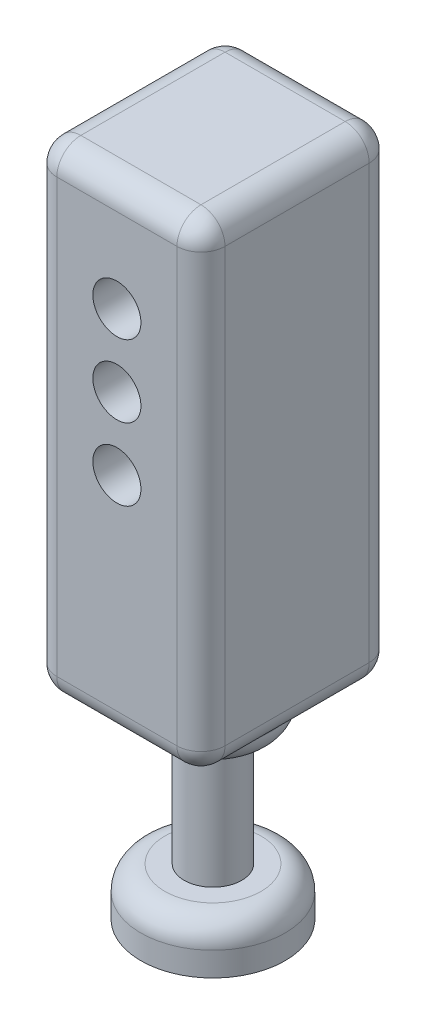
ISO-10303-21;
HEADER;
FILE_DESCRIPTION(('STEP AP214'),'2;1');
FILE_NAME('part.step','',(''),(''),'','','');
FILE_SCHEMA(('AUTOMOTIVE_DESIGN { 1 0 10303 214 1 1 1 1 }'));
ENDSEC;
DATA;
#1=APPLICATION_CONTEXT('core data for automotive mechanical design processes');
#2=APPLICATION_PROTOCOL_DEFINITION('international standard','automotive_design',2000,#1);
#3=PRODUCT_CONTEXT('',#1,'mechanical');
#4=PRODUCT('Part','Part','',(#3));
#5=PRODUCT_RELATED_PRODUCT_CATEGORY('part','',(#4));
#6=PRODUCT_DEFINITION_FORMATION('','',#4);
#7=PRODUCT_DEFINITION_CONTEXT('part definition',#1,'design');
#8=PRODUCT_DEFINITION('design','',#6,#7);
#9=PRODUCT_DEFINITION_SHAPE('','',#8);
#10=(LENGTH_UNIT() NAMED_UNIT(*) SI_UNIT(.MILLI.,.METRE.));
#11=(NAMED_UNIT(*) PLANE_ANGLE_UNIT() SI_UNIT($,.RADIAN.));
#12=(NAMED_UNIT(*) SI_UNIT($,.STERADIAN.) SOLID_ANGLE_UNIT());
#13=UNCERTAINTY_MEASURE_WITH_UNIT(LENGTH_MEASURE(1.E-05),#10,'distance_accuracy_value','');
#14=(GEOMETRIC_REPRESENTATION_CONTEXT(3) GLOBAL_UNCERTAINTY_ASSIGNED_CONTEXT((#13)) GLOBAL_UNIT_ASSIGNED_CONTEXT((#10,
#11,#12)) REPRESENTATION_CONTEXT('',''));
#15=CARTESIAN_POINT('',(0.,0.,0.));
#16=DIRECTION('',(0.,0.,1.));
#17=DIRECTION('',(1.,0.,0.));
#18=AXIS2_PLACEMENT_3D('',#15,#16,#17);
#19=CARTESIAN_POINT('',(-14.7765246655152,101.448561813307,80.));
#20=DIRECTION('',(1.,0.,0.));
#21=DIRECTION('',(0.,1.,0.));
#22=AXIS2_PLACEMENT_3D('',#19,#20,#21);
#23=PLANE('',#22);
#24=DIRECTION('',(0.,-1.,0.));
#25=VECTOR('',#24,1.);
#26=CARTESIAN_POINT('',(-14.7765246655152,101.448561813307,9.99999999999999));
#27=LINE('',#26,#25);
#28=CARTESIAN_POINT('',(-14.7765246655152,91.4485618133073,9.99999999999999));
#29=VERTEX_POINT('',#28);
#30=CARTESIAN_POINT('',(-14.7765246655151,-88.5514381866927,9.99999999999999));
#31=VERTEX_POINT('',#30);
#32=EDGE_CURVE('E387',#29,#31,#27,.T.);
#33=ORIENTED_EDGE('',*,*,#32,.T.);
#34=DIRECTION('',(0.,0.,-1.));
#35=VECTOR('',#34,1.);
#36=CARTESIAN_POINT('',(-14.7765246655151,-88.5514381866927,80.));
#37=LINE('',#36,#35);
#38=CARTESIAN_POINT('',(-14.7765246655151,-88.5514381866927,70.));
#39=VERTEX_POINT('',#38);
#40=EDGE_CURVE('E391',#31,#39,#37,.F.);
#41=ORIENTED_EDGE('',*,*,#40,.T.);
#42=DIRECTION('',(0.,-1.,0.));
#43=VECTOR('',#42,1.);
#44=CARTESIAN_POINT('',(-14.7765246655152,101.448561813307,70.));
#45=LINE('',#44,#43);
#46=CARTESIAN_POINT('',(-14.7765246655152,91.4485618133073,70.));
#47=VERTEX_POINT('',#46);
#48=EDGE_CURVE('E389',#39,#47,#45,.F.);
#49=ORIENTED_EDGE('',*,*,#48,.T.);
#50=DIRECTION('',(0.,0.,-1.));
#51=VECTOR('',#50,1.);
#52=CARTESIAN_POINT('',(-14.7765246655152,91.4485618133073,80.));
#53=LINE('',#52,#51);
#54=EDGE_CURVE('E385',#47,#29,#53,.T.);
#55=ORIENTED_EDGE('',*,*,#54,.T.);
#56=EDGE_LOOP('',(#33,#41,#49,#55));
#57=FACE_BOUND('',#56,.T.);
#58=ADVANCED_FACE('F38',(#57),#23,.F.);
#59=CARTESIAN_POINT('',(-14.7765246655151,-98.5514381866927,80.));
#60=DIRECTION('',(0.,1.,0.));
#61=DIRECTION('',(0.,0.,1.));
#62=AXIS2_PLACEMENT_3D('',#59,#60,#61);
#63=PLANE('',#62);
#64=CARTESIAN_POINT('',(20.2234753344849,-98.5514381866927,40.));
#65=DIRECTION('',(0.,1.,0.));
#66=DIRECTION('',(0.,0.,1.));
#67=AXIS2_PLACEMENT_3D('',#64,#65,#66);
#68=CIRCLE('',#67,24.4425210792579);
#69=CARTESIAN_POINT('',(20.2234753344849,-98.5514381866927,64.4425210792579));
#70=VERTEX_POINT('',#69);
#71=EDGE_CURVE('E208',#70,#70,#68,.F.);
#72=ORIENTED_EDGE('',*,*,#71,.F.);
#73=EDGE_LOOP('',(#72));
#74=FACE_BOUND('',#73,.T.);
#75=DIRECTION('',(1.,0.,0.));
#76=VECTOR('',#75,1.);
#77=CARTESIAN_POINT('',(-14.7765246655151,-98.5514381866927,70.));
#78=LINE('',#77,#76);
#79=CARTESIAN_POINT('',(45.2234753344849,-98.5514381866927,70.));
#80=VERTEX_POINT('',#79);
#81=CARTESIAN_POINT('',(-4.77652466551515,-98.5514381866927,70.));
#82=VERTEX_POINT('',#81);
#83=EDGE_CURVE('E140',#80,#82,#78,.F.);
#84=ORIENTED_EDGE('',*,*,#83,.T.);
#85=DIRECTION('',(0.,0.,-1.));
#86=VECTOR('',#85,1.);
#87=CARTESIAN_POINT('',(-4.77652466551515,-98.5514381866927,80.));
#88=LINE('',#87,#86);
#89=CARTESIAN_POINT('',(-4.77652466551515,-98.5514381866927,9.99999999999999));
#90=VERTEX_POINT('',#89);
#91=EDGE_CURVE('E136',#82,#90,#88,.T.);
#92=ORIENTED_EDGE('',*,*,#91,.T.);
#93=DIRECTION('',(1.,0.,0.));
#94=VECTOR('',#93,1.);
#95=CARTESIAN_POINT('',(-14.7765246655151,-98.5514381866927,9.99999999999999));
#96=LINE('',#95,#94);
#97=CARTESIAN_POINT('',(45.2234753344849,-98.5514381866927,9.99999999999999));
#98=VERTEX_POINT('',#97);
#99=EDGE_CURVE('E130',#90,#98,#96,.T.);
#100=ORIENTED_EDGE('',*,*,#99,.T.);
#101=DIRECTION('',(0.,0.,-1.));
#102=VECTOR('',#101,1.);
#103=CARTESIAN_POINT('',(45.2234753344849,-98.5514381866927,80.));
#104=LINE('',#103,#102);
#105=EDGE_CURVE('E133',#98,#80,#104,.F.);
#106=ORIENTED_EDGE('',*,*,#105,.T.);
#107=EDGE_LOOP('',(#84,#92,#100,#106));
#108=FACE_BOUND('',#107,.T.);
#109=ADVANCED_FACE('F132',(#74,#108),#63,.F.);
#110=CARTESIAN_POINT('',(55.2234753344848,101.448561813307,80.));
#111=DIRECTION('',(-1.,0.,0.));
#112=DIRECTION('',(0.,-1.,0.));
#113=AXIS2_PLACEMENT_3D('',#110,#111,#112);
#114=PLANE('',#113);
#115=DIRECTION('',(0.,1.,0.));
#116=VECTOR('',#115,1.);
#117=CARTESIAN_POINT('',(55.2234753344849,-98.5514381866927,70.));
#118=LINE('',#117,#116);
#119=CARTESIAN_POINT('',(55.2234753344848,91.4485618133073,70.));
#120=VERTEX_POINT('',#119);
#121=CARTESIAN_POINT('',(55.2234753344849,-88.5514381866927,70.));
#122=VERTEX_POINT('',#121);
#123=EDGE_CURVE('E362',#120,#122,#118,.F.);
#124=ORIENTED_EDGE('',*,*,#123,.T.);
#125=DIRECTION('',(0.,0.,-1.));
#126=VECTOR('',#125,1.);
#127=CARTESIAN_POINT('',(55.2234753344849,-88.5514381866927,80.));
#128=LINE('',#127,#126);
#129=CARTESIAN_POINT('',(55.2234753344849,-88.5514381866927,9.99999999999999));
#130=VERTEX_POINT('',#129);
#131=EDGE_CURVE('E363',#122,#130,#128,.T.);
#132=ORIENTED_EDGE('',*,*,#131,.T.);
#133=DIRECTION('',(0.,1.,0.));
#134=VECTOR('',#133,1.);
#135=CARTESIAN_POINT('',(55.2234753344848,101.448561813307,9.99999999999999));
#136=LINE('',#135,#134);
#137=CARTESIAN_POINT('',(55.2234753344848,91.4485618133073,9.99999999999999));
#138=VERTEX_POINT('',#137);
#139=EDGE_CURVE('E368',#130,#138,#136,.T.);
#140=ORIENTED_EDGE('',*,*,#139,.T.);
#141=DIRECTION('',(0.,0.,-1.));
#142=VECTOR('',#141,1.);
#143=CARTESIAN_POINT('',(55.2234753344848,91.4485618133073,80.));
#144=LINE('',#143,#142);
#145=EDGE_CURVE('E365',#138,#120,#144,.F.);
#146=ORIENTED_EDGE('',*,*,#145,.T.);
#147=EDGE_LOOP('',(#124,#132,#140,#146));
#148=FACE_BOUND('',#147,.T.);
#149=ADVANCED_FACE('F243',(#148),#114,.F.);
#150=CARTESIAN_POINT('',(-14.7765246655152,101.448561813307,80.));
#151=DIRECTION('',(0.,-1.,0.));
#152=DIRECTION('',(0.,0.,-1.));
#153=AXIS2_PLACEMENT_3D('',#150,#151,#152);
#154=PLANE('',#153);
#155=DIRECTION('',(-1.,0.,0.));
#156=VECTOR('',#155,1.);
#157=CARTESIAN_POINT('',(55.2234753344848,101.448561813307,70.));
#158=LINE('',#157,#156);
#159=CARTESIAN_POINT('',(-4.77652466551517,101.448561813307,70.));
#160=VERTEX_POINT('',#159);
#161=CARTESIAN_POINT('',(45.2234753344848,101.448561813307,70.));
#162=VERTEX_POINT('',#161);
#163=EDGE_CURVE('E413',#160,#162,#158,.F.);
#164=ORIENTED_EDGE('',*,*,#163,.T.);
#165=DIRECTION('',(0.,0.,-1.));
#166=VECTOR('',#165,1.);
#167=CARTESIAN_POINT('',(45.2234753344848,101.448561813307,80.));
#168=LINE('',#167,#166);
#169=CARTESIAN_POINT('',(45.2234753344848,101.448561813307,9.99999999999999));
#170=VERTEX_POINT('',#169);
#171=EDGE_CURVE('E61',#162,#170,#168,.T.);
#172=ORIENTED_EDGE('',*,*,#171,.T.);
#173=DIRECTION('',(-1.,0.,0.));
#174=VECTOR('',#173,1.);
#175=CARTESIAN_POINT('',(-14.7765246655152,101.448561813307,9.99999999999999));
#176=LINE('',#175,#174);
#177=CARTESIAN_POINT('',(-4.77652466551517,101.448561813307,9.99999999999999));
#178=VERTEX_POINT('',#177);
#179=EDGE_CURVE('E411',#170,#178,#176,.T.);
#180=ORIENTED_EDGE('',*,*,#179,.T.);
#181=DIRECTION('',(0.,0.,-1.));
#182=VECTOR('',#181,1.);
#183=CARTESIAN_POINT('',(-4.77652466551517,101.448561813307,80.));
#184=LINE('',#183,#182);
#185=EDGE_CURVE('E370',#178,#160,#184,.F.);
#186=ORIENTED_EDGE('',*,*,#185,.T.);
#187=EDGE_LOOP('',(#164,#172,#180,#186));
#188=FACE_BOUND('',#187,.T.);
#189=ADVANCED_FACE('F350',(#188),#154,.F.);
#190=CARTESIAN_POINT('',(0.,0.,80.));
#191=DIRECTION('',(0.,0.,1.));
#192=DIRECTION('',(1.,0.,0.));
#193=AXIS2_PLACEMENT_3D('',#190,#191,#192);
#194=PLANE('',#193);
#195=CARTESIAN_POINT('',(20.2234753344848,56.4485618133073,80.));
#196=DIRECTION('',(0.,0.,1.));
#197=DIRECTION('',(1.,0.,0.));
#198=AXIS2_PLACEMENT_3D('',#195,#196,#197);
#199=CIRCLE('',#198,10.);
#200=CARTESIAN_POINT('',(30.2234753344848,56.4485618133073,80.));
#201=VERTEX_POINT('',#200);
#202=EDGE_CURVE('E474',#201,#201,#199,.T.);
#203=ORIENTED_EDGE('',*,*,#202,.F.);
#204=EDGE_LOOP('',(#203));
#205=FACE_BOUND('',#204,.T.);
#206=CARTESIAN_POINT('',(20.2234753344848,26.4485618133073,80.));
#207=DIRECTION('',(0.,0.,1.));
#208=DIRECTION('',(1.,0.,0.));
#209=AXIS2_PLACEMENT_3D('',#206,#207,#208);
#210=CIRCLE('',#209,10.);
#211=CARTESIAN_POINT('',(30.2234753344848,26.4485618133073,80.));
#212=VERTEX_POINT('',#211);
#213=EDGE_CURVE('E468',#212,#212,#210,.T.);
#214=ORIENTED_EDGE('',*,*,#213,.F.);
#215=EDGE_LOOP('',(#214));
#216=FACE_BOUND('',#215,.T.);
#217=CARTESIAN_POINT('',(20.2234753344848,-3.55143818669267,80.));
#218=DIRECTION('',(0.,0.,1.));
#219=DIRECTION('',(1.,0.,0.));
#220=AXIS2_PLACEMENT_3D('',#217,#218,#219);
#221=CIRCLE('',#220,10.);
#222=CARTESIAN_POINT('',(30.2234753344848,-3.55143818669267,80.));
#223=VERTEX_POINT('',#222);
#224=EDGE_CURVE('E462',#223,#223,#221,.T.);
#225=ORIENTED_EDGE('',*,*,#224,.F.);
#226=EDGE_LOOP('',(#225));
#227=FACE_BOUND('',#226,.T.);
#228=DIRECTION('',(0.,-1.,0.));
#229=VECTOR('',#228,1.);
#230=CARTESIAN_POINT('',(-4.77652466551514,-98.5514381866927,80.));
#231=LINE('',#230,#229);
#232=CARTESIAN_POINT('',(-4.77652466551517,91.4485618133073,80.));
#233=VERTEX_POINT('',#232);
#234=CARTESIAN_POINT('',(-4.77652466551514,-88.5514381866927,80.));
#235=VERTEX_POINT('',#234);
#236=EDGE_CURVE('E403',#233,#235,#231,.T.);
#237=ORIENTED_EDGE('',*,*,#236,.T.);
#238=DIRECTION('',(1.,0.,0.));
#239=VECTOR('',#238,1.);
#240=CARTESIAN_POINT('',(55.2234753344849,-88.5514381866927,80.));
#241=LINE('',#240,#239);
#242=CARTESIAN_POINT('',(45.2234753344849,-88.5514381866927,80.));
#243=VERTEX_POINT('',#242);
#244=EDGE_CURVE('E406',#235,#243,#241,.T.);
#245=ORIENTED_EDGE('',*,*,#244,.T.);
#246=DIRECTION('',(0.,1.,0.));
#247=VECTOR('',#246,1.);
#248=CARTESIAN_POINT('',(45.2234753344848,101.448561813307,80.));
#249=LINE('',#248,#247);
#250=CARTESIAN_POINT('',(45.2234753344848,91.4485618133073,80.));
#251=VERTEX_POINT('',#250);
#252=EDGE_CURVE('E373',#243,#251,#249,.T.);
#253=ORIENTED_EDGE('',*,*,#252,.T.);
#254=DIRECTION('',(-1.,0.,0.));
#255=VECTOR('',#254,1.);
#256=CARTESIAN_POINT('',(-14.7765246655152,91.4485618133073,80.));
#257=LINE('',#256,#255);
#258=EDGE_CURVE('E401',#251,#233,#257,.T.);
#259=ORIENTED_EDGE('',*,*,#258,.T.);
#260=EDGE_LOOP('',(#237,#245,#253,#259));
#261=FACE_BOUND('',#260,.T.);
#262=ADVANCED_FACE('F347',(#205,#216,#227,#261),#194,.T.);
#263=CARTESIAN_POINT('',(0.,0.,0.));
#264=DIRECTION('',(0.,0.,1.));
#265=DIRECTION('',(1.,0.,0.));
#266=AXIS2_PLACEMENT_3D('',#263,#264,#265);
#267=PLANE('',#266);
#268=CARTESIAN_POINT('',(20.2234753344848,56.4485618133073,0.));
#269=DIRECTION('',(0.,0.,1.));
#270=DIRECTION('',(1.,0.,0.));
#271=AXIS2_PLACEMENT_3D('',#268,#269,#270);
#272=CIRCLE('',#271,10.);
#273=CARTESIAN_POINT('',(30.2234753344848,56.4485618133073,0.));
#274=VERTEX_POINT('',#273);
#275=EDGE_CURVE('E461',#274,#274,#272,.T.);
#276=ORIENTED_EDGE('',*,*,#275,.T.);
#277=EDGE_LOOP('',(#276));
#278=FACE_BOUND('',#277,.T.);
#279=CARTESIAN_POINT('',(20.2234753344848,26.4485618133073,0.));
#280=DIRECTION('',(0.,0.,1.));
#281=DIRECTION('',(1.,0.,0.));
#282=AXIS2_PLACEMENT_3D('',#279,#280,#281);
#283=CIRCLE('',#282,10.);
#284=CARTESIAN_POINT('',(30.2234753344848,26.4485618133073,0.));
#285=VERTEX_POINT('',#284);
#286=EDGE_CURVE('E471',#285,#285,#283,.T.);
#287=ORIENTED_EDGE('',*,*,#286,.T.);
#288=EDGE_LOOP('',(#287));
#289=FACE_BOUND('',#288,.T.);
#290=CARTESIAN_POINT('',(20.2234753344848,-3.55143818669267,0.));
#291=DIRECTION('',(0.,0.,1.));
#292=DIRECTION('',(1.,0.,0.));
#293=AXIS2_PLACEMENT_3D('',#290,#291,#292);
#294=CIRCLE('',#293,10.);
#295=CARTESIAN_POINT('',(30.2234753344848,-3.55143818669267,0.));
#296=VERTEX_POINT('',#295);
#297=EDGE_CURVE('E465',#296,#296,#294,.T.);
#298=ORIENTED_EDGE('',*,*,#297,.T.);
#299=EDGE_LOOP('',(#298));
#300=FACE_BOUND('',#299,.T.);
#301=DIRECTION('',(0.,1.,0.));
#302=VECTOR('',#301,1.);
#303=CARTESIAN_POINT('',(45.2234753344848,0.,0.));
#304=LINE('',#303,#302);
#305=CARTESIAN_POINT('',(45.2234753344848,91.4485618133073,0.));
#306=VERTEX_POINT('',#305);
#307=CARTESIAN_POINT('',(45.2234753344849,-88.5514381866927,0.));
#308=VERTEX_POINT('',#307);
#309=EDGE_CURVE('E398',#306,#308,#304,.F.);
#310=ORIENTED_EDGE('',*,*,#309,.T.);
#311=DIRECTION('',(1.,0.,0.));
#312=VECTOR('',#311,1.);
#313=CARTESIAN_POINT('',(0.,-88.5514381866927,0.));
#314=LINE('',#313,#312);
#315=CARTESIAN_POINT('',(-4.77652466551514,-88.5514381866927,0.));
#316=VERTEX_POINT('',#315);
#317=EDGE_CURVE('E164',#308,#316,#314,.F.);
#318=ORIENTED_EDGE('',*,*,#317,.T.);
#319=DIRECTION('',(0.,-1.,0.));
#320=VECTOR('',#319,1.);
#321=CARTESIAN_POINT('',(-4.77652466551516,0.,0.));
#322=LINE('',#321,#320);
#323=CARTESIAN_POINT('',(-4.77652466551517,91.4485618133073,0.));
#324=VERTEX_POINT('',#323);
#325=EDGE_CURVE('E396',#316,#324,#322,.F.);
#326=ORIENTED_EDGE('',*,*,#325,.T.);
#327=DIRECTION('',(-1.,0.,0.));
#328=VECTOR('',#327,1.);
#329=CARTESIAN_POINT('',(0.,91.4485618133073,0.));
#330=LINE('',#329,#328);
#331=EDGE_CURVE('E394',#324,#306,#330,.F.);
#332=ORIENTED_EDGE('',*,*,#331,.T.);
#333=EDGE_LOOP('',(#310,#318,#326,#332));
#334=FACE_BOUND('',#333,.T.);
#335=ADVANCED_FACE('F320',(#278,#289,#300,#334),#267,.F.);
#336=CARTESIAN_POINT('',(45.2234753344848,91.4485618133073,80.));
#337=DIRECTION('',(0.,0.,-1.));
#338=DIRECTION('',(-1.,0.,0.));
#339=AXIS2_PLACEMENT_3D('',#336,#337,#338);
#340=CYLINDRICAL_SURFACE('',#339,10.);
#341=CARTESIAN_POINT('',(45.2234753344848,91.4485618133073,70.));
#342=DIRECTION('',(0.,0.,1.));
#343=DIRECTION('',(1.,0.,0.));
#344=AXIS2_PLACEMENT_3D('',#341,#342,#343);
#345=CIRCLE('',#344,10.);
#346=EDGE_CURVE('E152',#120,#162,#345,.T.);
#347=ORIENTED_EDGE('',*,*,#346,.F.);
#348=ORIENTED_EDGE('',*,*,#145,.F.);
#349=CARTESIAN_POINT('',(45.2234753344848,91.4485618133073,9.99999999999999));
#350=DIRECTION('',(0.,0.,-1.));
#351=DIRECTION('',(-1.,0.,0.));
#352=AXIS2_PLACEMENT_3D('',#349,#350,#351);
#353=CIRCLE('',#352,10.);
#354=EDGE_CURVE('E204',#170,#138,#353,.T.);
#355=ORIENTED_EDGE('',*,*,#354,.F.);
#356=ORIENTED_EDGE('',*,*,#171,.F.);
#357=EDGE_LOOP('',(#347,#348,#355,#356));
#358=FACE_BOUND('',#357,.T.);
#359=ADVANCED_FACE('F317',(#358),#340,.T.);
#360=CARTESIAN_POINT('',(45.2234753344848,91.4485618133073,70.));
#361=DIRECTION('',(0.,0.,1.));
#362=DIRECTION('',(1.,0.,0.));
#363=AXIS2_PLACEMENT_3D('',#360,#361,#362);
#364=SPHERICAL_SURFACE('',#363,10.);
#365=CARTESIAN_POINT('',(45.2234753344848,91.4485618133073,70.));
#366=DIRECTION('',(0.,1.,0.));
#367=DIRECTION('',(0.,0.,1.));
#368=AXIS2_PLACEMENT_3D('',#365,#366,#367);
#369=CIRCLE('',#368,10.);
#370=EDGE_CURVE('E200',#120,#251,#369,.F.);
#371=ORIENTED_EDGE('',*,*,#370,.F.);
#372=ORIENTED_EDGE('',*,*,#346,.T.);
#373=CARTESIAN_POINT('',(45.2234753344848,91.4485618133073,70.));
#374=DIRECTION('',(1.,0.,0.));
#375=DIRECTION('',(0.,0.,-1.));
#376=AXIS2_PLACEMENT_3D('',#373,#374,#375);
#377=CIRCLE('',#376,10.);
#378=EDGE_CURVE('E53',#251,#162,#377,.F.);
#379=ORIENTED_EDGE('',*,*,#378,.F.);
#380=EDGE_LOOP('',(#371,#372,#379));
#381=FACE_BOUND('',#380,.T.);
#382=ADVANCED_FACE('F313',(#381),#364,.T.);
#383=CARTESIAN_POINT('',(45.2234753344848,91.4485618133073,10.));
#384=DIRECTION('',(0.,0.,1.));
#385=DIRECTION('',(1.,0.,0.));
#386=AXIS2_PLACEMENT_3D('',#383,#384,#385);
#387=SPHERICAL_SURFACE('',#386,10.);
#388=CARTESIAN_POINT('',(45.2234753344848,91.4485618133073,10.));
#389=DIRECTION('',(1.,0.,0.));
#390=DIRECTION('',(0.,0.,-1.));
#391=AXIS2_PLACEMENT_3D('',#388,#389,#390);
#392=CIRCLE('',#391,10.);
#393=EDGE_CURVE('E194',#170,#306,#392,.F.);
#394=ORIENTED_EDGE('',*,*,#393,.F.);
#395=ORIENTED_EDGE('',*,*,#354,.T.);
#396=CARTESIAN_POINT('',(45.2234753344848,91.4485618133073,9.99999999999999));
#397=DIRECTION('',(0.,1.,0.));
#398=DIRECTION('',(0.,0.,1.));
#399=AXIS2_PLACEMENT_3D('',#396,#397,#398);
#400=CIRCLE('',#399,10.);
#401=EDGE_CURVE('E197',#306,#138,#400,.F.);
#402=ORIENTED_EDGE('',*,*,#401,.F.);
#403=EDGE_LOOP('',(#394,#395,#402));
#404=FACE_BOUND('',#403,.T.);
#405=ADVANCED_FACE('F310',(#404),#387,.T.);
#406=CARTESIAN_POINT('',(0.,91.4485618133073,70.));
#407=DIRECTION('',(1.,0.,0.));
#408=DIRECTION('',(0.,0.,-1.));
#409=AXIS2_PLACEMENT_3D('',#406,#407,#408);
#410=CYLINDRICAL_SURFACE('',#409,10.);
#411=ORIENTED_EDGE('',*,*,#378,.T.);
#412=ORIENTED_EDGE('',*,*,#163,.F.);
#413=CARTESIAN_POINT('',(-4.77652466551517,91.4485618133073,70.));
#414=DIRECTION('',(-1.,0.,0.));
#415=DIRECTION('',(0.,0.,1.));
#416=AXIS2_PLACEMENT_3D('',#413,#414,#415);
#417=CIRCLE('',#416,10.);
#418=EDGE_CURVE('E188',#233,#160,#417,.T.);
#419=ORIENTED_EDGE('',*,*,#418,.F.);
#420=ORIENTED_EDGE('',*,*,#258,.F.);
#421=EDGE_LOOP('',(#411,#412,#419,#420));
#422=FACE_BOUND('',#421,.T.);
#423=ADVANCED_FACE('F306',(#422),#410,.T.);
#424=CARTESIAN_POINT('',(45.2234753344848,0.,70.));
#425=DIRECTION('',(0.,-1.,0.));
#426=DIRECTION('',(1.,0.,0.));
#427=AXIS2_PLACEMENT_3D('',#424,#425,#426);
#428=CYLINDRICAL_SURFACE('',#427,10.);
#429=ORIENTED_EDGE('',*,*,#370,.T.);
#430=ORIENTED_EDGE('',*,*,#252,.F.);
#431=CARTESIAN_POINT('',(45.2234753344849,-88.5514381866927,70.));
#432=DIRECTION('',(0.,-1.,0.));
#433=DIRECTION('',(0.,0.,-1.));
#434=AXIS2_PLACEMENT_3D('',#431,#432,#433);
#435=CIRCLE('',#434,10.);
#436=EDGE_CURVE('E185',#122,#243,#435,.T.);
#437=ORIENTED_EDGE('',*,*,#436,.F.);
#438=ORIENTED_EDGE('',*,*,#123,.F.);
#439=EDGE_LOOP('',(#429,#430,#437,#438));
#440=FACE_BOUND('',#439,.T.);
#441=ADVANCED_FACE('F303',(#440),#428,.T.);
#442=CARTESIAN_POINT('',(45.2234753344849,-88.5514381866927,80.));
#443=DIRECTION('',(0.,0.,-1.));
#444=DIRECTION('',(-1.,0.,0.));
#445=AXIS2_PLACEMENT_3D('',#442,#443,#444);
#446=CYLINDRICAL_SURFACE('',#445,10.);
#447=CARTESIAN_POINT('',(45.2234753344849,-88.5514381866927,9.99999999999999));
#448=DIRECTION('',(0.,0.,-1.));
#449=DIRECTION('',(-1.,0.,0.));
#450=AXIS2_PLACEMENT_3D('',#447,#448,#449);
#451=CIRCLE('',#450,10.);
#452=EDGE_CURVE('E147',#130,#98,#451,.T.);
#453=ORIENTED_EDGE('',*,*,#452,.F.);
#454=ORIENTED_EDGE('',*,*,#131,.F.);
#455=CARTESIAN_POINT('',(45.2234753344849,-88.5514381866927,70.));
#456=DIRECTION('',(0.,0.,1.));
#457=DIRECTION('',(1.,0.,0.));
#458=AXIS2_PLACEMENT_3D('',#455,#456,#457);
#459=CIRCLE('',#458,10.);
#460=EDGE_CURVE('E150',#80,#122,#459,.T.);
#461=ORIENTED_EDGE('',*,*,#460,.F.);
#462=ORIENTED_EDGE('',*,*,#105,.F.);
#463=EDGE_LOOP('',(#453,#454,#461,#462));
#464=FACE_BOUND('',#463,.T.);
#465=ADVANCED_FACE('F145',(#464),#446,.T.);
#466=CARTESIAN_POINT('',(45.2234753344848,101.448561813307,9.99999999999999));
#467=DIRECTION('',(0.,1.,0.));
#468=DIRECTION('',(-1.,0.,0.));
#469=AXIS2_PLACEMENT_3D('',#466,#467,#468);
#470=CYLINDRICAL_SURFACE('',#469,10.);
#471=ORIENTED_EDGE('',*,*,#401,.T.);
#472=ORIENTED_EDGE('',*,*,#139,.F.);
#473=CARTESIAN_POINT('',(45.2234753344849,-88.5514381866927,10.));
#474=DIRECTION('',(0.,-1.,0.));
#475=DIRECTION('',(1.,0.,0.));
#476=AXIS2_PLACEMENT_3D('',#473,#474,#475);
#477=CIRCLE('',#476,10.);
#478=EDGE_CURVE('E160',#308,#130,#477,.T.);
#479=ORIENTED_EDGE('',*,*,#478,.F.);
#480=ORIENTED_EDGE('',*,*,#309,.F.);
#481=EDGE_LOOP('',(#471,#472,#479,#480));
#482=FACE_BOUND('',#481,.T.);
#483=ADVANCED_FACE('F296',(#482),#470,.T.);
#484=CARTESIAN_POINT('',(-14.7765246655152,91.4485618133073,9.99999999999999));
#485=DIRECTION('',(-1.,0.,0.));
#486=DIRECTION('',(0.,0.,1.));
#487=AXIS2_PLACEMENT_3D('',#484,#485,#486);
#488=CYLINDRICAL_SURFACE('',#487,10.);
#489=ORIENTED_EDGE('',*,*,#393,.T.);
#490=ORIENTED_EDGE('',*,*,#331,.F.);
#491=CARTESIAN_POINT('',(-4.77652466551517,91.4485618133073,9.99999999999999));
#492=DIRECTION('',(-1.,0.,0.));
#493=DIRECTION('',(0.,0.,1.));
#494=AXIS2_PLACEMENT_3D('',#491,#492,#493);
#495=CIRCLE('',#494,10.);
#496=EDGE_CURVE('E180',#178,#324,#495,.T.);
#497=ORIENTED_EDGE('',*,*,#496,.F.);
#498=ORIENTED_EDGE('',*,*,#179,.F.);
#499=EDGE_LOOP('',(#489,#490,#497,#498));
#500=FACE_BOUND('',#499,.T.);
#501=ADVANCED_FACE('F292',(#500),#488,.T.);
#502=CARTESIAN_POINT('',(-4.77652466551517,91.4485618133073,80.));
#503=DIRECTION('',(0.,0.,-1.));
#504=DIRECTION('',(-1.,0.,0.));
#505=AXIS2_PLACEMENT_3D('',#502,#503,#504);
#506=CYLINDRICAL_SURFACE('',#505,10.);
#507=CARTESIAN_POINT('',(-4.77652466551517,91.4485618133073,70.));
#508=DIRECTION('',(0.,0.,1.));
#509=DIRECTION('',(1.,0.,0.));
#510=AXIS2_PLACEMENT_3D('',#507,#508,#509);
#511=CIRCLE('',#510,10.);
#512=EDGE_CURVE('E191',#160,#47,#511,.T.);
#513=ORIENTED_EDGE('',*,*,#512,.F.);
#514=ORIENTED_EDGE('',*,*,#185,.F.);
#515=CARTESIAN_POINT('',(-4.77652466551517,91.4485618133073,9.99999999999999));
#516=DIRECTION('',(0.,0.,-1.));
#517=DIRECTION('',(-1.,0.,0.));
#518=AXIS2_PLACEMENT_3D('',#515,#516,#517);
#519=CIRCLE('',#518,10.);
#520=EDGE_CURVE('E177',#29,#178,#519,.T.);
#521=ORIENTED_EDGE('',*,*,#520,.F.);
#522=ORIENTED_EDGE('',*,*,#54,.F.);
#523=EDGE_LOOP('',(#513,#514,#521,#522));
#524=FACE_BOUND('',#523,.T.);
#525=ADVANCED_FACE('F288',(#524),#506,.T.);
#526=CARTESIAN_POINT('',(-4.77652466551517,91.4485618133073,70.));
#527=DIRECTION('',(0.,0.,1.));
#528=DIRECTION('',(1.,0.,0.));
#529=AXIS2_PLACEMENT_3D('',#526,#527,#528);
#530=SPHERICAL_SURFACE('',#529,10.);
#531=ORIENTED_EDGE('',*,*,#418,.T.);
#532=ORIENTED_EDGE('',*,*,#512,.T.);
#533=CARTESIAN_POINT('',(-4.77652466551517,91.4485618133073,70.));
#534=DIRECTION('',(0.,1.,0.));
#535=DIRECTION('',(0.,0.,1.));
#536=AXIS2_PLACEMENT_3D('',#533,#534,#535);
#537=CIRCLE('',#536,10.);
#538=EDGE_CURVE('E168',#233,#47,#537,.F.);
#539=ORIENTED_EDGE('',*,*,#538,.F.);
#540=EDGE_LOOP('',(#531,#532,#539));
#541=FACE_BOUND('',#540,.T.);
#542=ADVANCED_FACE('F284',(#541),#530,.T.);
#543=CARTESIAN_POINT('',(45.2234753344849,-88.5514381866927,70.));
#544=DIRECTION('',(0.,0.,1.));
#545=DIRECTION('',(1.,0.,0.));
#546=AXIS2_PLACEMENT_3D('',#543,#544,#545);
#547=SPHERICAL_SURFACE('',#546,10.);
#548=ORIENTED_EDGE('',*,*,#460,.T.);
#549=ORIENTED_EDGE('',*,*,#436,.T.);
#550=CARTESIAN_POINT('',(45.2234753344849,-88.5514381866927,70.));
#551=DIRECTION('',(1.,0.,0.));
#552=DIRECTION('',(0.,0.,-1.));
#553=AXIS2_PLACEMENT_3D('',#550,#551,#552);
#554=CIRCLE('',#553,10.);
#555=EDGE_CURVE('E165',#80,#243,#554,.F.);
#556=ORIENTED_EDGE('',*,*,#555,.F.);
#557=EDGE_LOOP('',(#548,#549,#556));
#558=FACE_BOUND('',#557,.T.);
#559=ADVANCED_FACE('F281',(#558),#547,.T.);
#560=CARTESIAN_POINT('',(45.2234753344849,-88.5514381866927,10.));
#561=DIRECTION('',(0.,0.,1.));
#562=DIRECTION('',(1.,0.,0.));
#563=AXIS2_PLACEMENT_3D('',#560,#561,#562);
#564=SPHERICAL_SURFACE('',#563,10.);
#565=ORIENTED_EDGE('',*,*,#478,.T.);
#566=ORIENTED_EDGE('',*,*,#452,.T.);
#567=CARTESIAN_POINT('',(45.2234753344849,-88.5514381866927,9.99999999999999));
#568=DIRECTION('',(1.,0.,0.));
#569=DIRECTION('',(0.,0.,-1.));
#570=AXIS2_PLACEMENT_3D('',#567,#568,#569);
#571=CIRCLE('',#570,10.);
#572=EDGE_CURVE('E157',#308,#98,#571,.F.);
#573=ORIENTED_EDGE('',*,*,#572,.F.);
#574=EDGE_LOOP('',(#565,#566,#573));
#575=FACE_BOUND('',#574,.T.);
#576=ADVANCED_FACE('F156',(#575),#564,.T.);
#577=CARTESIAN_POINT('',(-4.77652466551517,91.4485618133073,10.));
#578=DIRECTION('',(0.,0.,1.));
#579=DIRECTION('',(1.,0.,0.));
#580=AXIS2_PLACEMENT_3D('',#577,#578,#579);
#581=SPHERICAL_SURFACE('',#580,10.);
#582=ORIENTED_EDGE('',*,*,#520,.T.);
#583=ORIENTED_EDGE('',*,*,#496,.T.);
#584=CARTESIAN_POINT('',(-4.77652466551517,91.4485618133073,10.));
#585=DIRECTION('',(0.,1.,0.));
#586=DIRECTION('',(0.,0.,1.));
#587=AXIS2_PLACEMENT_3D('',#584,#585,#586);
#588=CIRCLE('',#587,10.);
#589=EDGE_CURVE('E166',#29,#324,#588,.F.);
#590=ORIENTED_EDGE('',*,*,#589,.F.);
#591=EDGE_LOOP('',(#582,#583,#590));
#592=FACE_BOUND('',#591,.T.);
#593=ADVANCED_FACE('F274',(#592),#581,.T.);
#594=CARTESIAN_POINT('',(-4.77652466551516,0.,70.));
#595=DIRECTION('',(0.,1.,0.));
#596=DIRECTION('',(-1.,0.,0.));
#597=AXIS2_PLACEMENT_3D('',#594,#595,#596);
#598=CYLINDRICAL_SURFACE('',#597,10.);
#599=ORIENTED_EDGE('',*,*,#538,.T.);
#600=ORIENTED_EDGE('',*,*,#48,.F.);
#601=CARTESIAN_POINT('',(-4.77652466551514,-88.5514381866927,70.));
#602=DIRECTION('',(0.,-1.,0.));
#603=DIRECTION('',(0.,0.,-1.));
#604=AXIS2_PLACEMENT_3D('',#601,#602,#603);
#605=CIRCLE('',#604,10.);
#606=EDGE_CURVE('E171',#235,#39,#605,.T.);
#607=ORIENTED_EDGE('',*,*,#606,.F.);
#608=ORIENTED_EDGE('',*,*,#236,.F.);
#609=EDGE_LOOP('',(#599,#600,#607,#608));
#610=FACE_BOUND('',#609,.T.);
#611=ADVANCED_FACE('F270',(#610),#598,.T.);
#612=CARTESIAN_POINT('',(0.,-88.5514381866927,70.));
#613=DIRECTION('',(-1.,0.,0.));
#614=DIRECTION('',(0.,0.,1.));
#615=AXIS2_PLACEMENT_3D('',#612,#613,#614);
#616=CYLINDRICAL_SURFACE('',#615,10.);
#617=ORIENTED_EDGE('',*,*,#555,.T.);
#618=ORIENTED_EDGE('',*,*,#244,.F.);
#619=CARTESIAN_POINT('',(-4.77652466551515,-88.5514381866927,70.));
#620=DIRECTION('',(-1.,0.,0.));
#621=DIRECTION('',(0.,0.,1.));
#622=AXIS2_PLACEMENT_3D('',#619,#620,#621);
#623=CIRCLE('',#622,10.);
#624=EDGE_CURVE('E379',#82,#235,#623,.T.);
#625=ORIENTED_EDGE('',*,*,#624,.F.);
#626=ORIENTED_EDGE('',*,*,#83,.F.);
#627=EDGE_LOOP('',(#617,#618,#625,#626));
#628=FACE_BOUND('',#627,.T.);
#629=ADVANCED_FACE('F267',(#628),#616,.T.);
#630=CARTESIAN_POINT('',(-14.7765246655151,-88.5514381866927,9.99999999999999));
#631=DIRECTION('',(1.,0.,0.));
#632=DIRECTION('',(0.,0.,-1.));
#633=AXIS2_PLACEMENT_3D('',#630,#631,#632);
#634=CYLINDRICAL_SURFACE('',#633,10.);
#635=ORIENTED_EDGE('',*,*,#572,.T.);
#636=ORIENTED_EDGE('',*,*,#99,.F.);
#637=CARTESIAN_POINT('',(-4.77652466551514,-88.5514381866927,10.));
#638=DIRECTION('',(-1.,0.,0.));
#639=DIRECTION('',(0.,-1.,0.));
#640=AXIS2_PLACEMENT_3D('',#637,#638,#639);
#641=CIRCLE('',#640,10.);
#642=EDGE_CURVE('E423',#316,#90,#641,.T.);
#643=ORIENTED_EDGE('',*,*,#642,.F.);
#644=ORIENTED_EDGE('',*,*,#317,.F.);
#645=EDGE_LOOP('',(#635,#636,#643,#644));
#646=FACE_BOUND('',#645,.T.);
#647=ADVANCED_FACE('F162',(#646),#634,.T.);
#648=CARTESIAN_POINT('',(-4.77652466551517,101.448561813307,9.99999999999999));
#649=DIRECTION('',(0.,-1.,0.));
#650=DIRECTION('',(1.,0.,0.));
#651=AXIS2_PLACEMENT_3D('',#648,#649,#650);
#652=CYLINDRICAL_SURFACE('',#651,10.);
#653=ORIENTED_EDGE('',*,*,#589,.T.);
#654=ORIENTED_EDGE('',*,*,#325,.F.);
#655=CARTESIAN_POINT('',(-4.77652466551515,-88.5514381866927,9.99999999999999));
#656=DIRECTION('',(0.,-1.,0.));
#657=DIRECTION('',(0.,0.,-1.));
#658=AXIS2_PLACEMENT_3D('',#655,#656,#657);
#659=CIRCLE('',#658,10.);
#660=EDGE_CURVE('E421',#31,#316,#659,.T.);
#661=ORIENTED_EDGE('',*,*,#660,.F.);
#662=ORIENTED_EDGE('',*,*,#32,.F.);
#663=EDGE_LOOP('',(#653,#654,#661,#662));
#664=FACE_BOUND('',#663,.T.);
#665=ADVANCED_FACE('F260',(#664),#652,.T.);
#666=CARTESIAN_POINT('',(-4.77652466551514,-88.5514381866927,70.));
#667=DIRECTION('',(0.,0.,1.));
#668=DIRECTION('',(1.,0.,0.));
#669=AXIS2_PLACEMENT_3D('',#666,#667,#668);
#670=SPHERICAL_SURFACE('',#669,10.);
#671=ORIENTED_EDGE('',*,*,#624,.T.);
#672=ORIENTED_EDGE('',*,*,#606,.T.);
#673=CARTESIAN_POINT('',(-4.77652466551515,-88.5514381866927,70.));
#674=DIRECTION('',(0.,0.,1.));
#675=DIRECTION('',(1.,0.,0.));
#676=AXIS2_PLACEMENT_3D('',#673,#674,#675);
#677=CIRCLE('',#676,10.);
#678=EDGE_CURVE('E418',#82,#39,#677,.F.);
#679=ORIENTED_EDGE('',*,*,#678,.F.);
#680=EDGE_LOOP('',(#671,#672,#679));
#681=FACE_BOUND('',#680,.T.);
#682=ADVANCED_FACE('F256',(#681),#670,.T.);
#683=CARTESIAN_POINT('',(-4.77652466551514,-88.5514381866927,10.));
#684=DIRECTION('',(0.,0.,1.));
#685=DIRECTION('',(1.,0.,0.));
#686=AXIS2_PLACEMENT_3D('',#683,#684,#685);
#687=SPHERICAL_SURFACE('',#686,10.);
#688=ORIENTED_EDGE('',*,*,#660,.T.);
#689=ORIENTED_EDGE('',*,*,#642,.T.);
#690=CARTESIAN_POINT('',(-4.77652466551515,-88.5514381866927,9.99999999999999));
#691=DIRECTION('',(0.,0.,-1.));
#692=DIRECTION('',(-1.,0.,0.));
#693=AXIS2_PLACEMENT_3D('',#690,#691,#692);
#694=CIRCLE('',#693,10.);
#695=EDGE_CURVE('E416',#31,#90,#694,.F.);
#696=ORIENTED_EDGE('',*,*,#695,.F.);
#697=EDGE_LOOP('',(#688,#689,#696));
#698=FACE_BOUND('',#697,.T.);
#699=ADVANCED_FACE('F252',(#698),#687,.T.);
#700=CARTESIAN_POINT('',(-4.77652466551515,-88.5514381866927,80.));
#701=DIRECTION('',(0.,0.,-1.));
#702=DIRECTION('',(-1.,0.,0.));
#703=AXIS2_PLACEMENT_3D('',#700,#701,#702);
#704=CYLINDRICAL_SURFACE('',#703,10.);
#705=ORIENTED_EDGE('',*,*,#678,.T.);
#706=ORIENTED_EDGE('',*,*,#40,.F.);
#707=ORIENTED_EDGE('',*,*,#695,.T.);
#708=ORIENTED_EDGE('',*,*,#91,.F.);
#709=EDGE_LOOP('',(#705,#706,#707,#708));
#710=FACE_BOUND('',#709,.T.);
#711=ADVANCED_FACE('F248',(#710),#704,.T.);
#712=CARTESIAN_POINT('',(20.2234753344848,-113.551438186693,40.));
#713=DIRECTION('',(0.,1.,0.));
#714=DIRECTION('',(-1.,0.,0.));
#715=AXIS2_PLACEMENT_3D('',#712,#713,#714);
#716=CYLINDRICAL_SURFACE('',#715,24.4425210792579);
#717=CARTESIAN_POINT('',(20.2234753344849,-103.551438186693,40.));
#718=DIRECTION('',(0.,-1.,0.));
#719=DIRECTION('',(1.,0.,0.));
#720=AXIS2_PLACEMENT_3D('',#717,#718,#719);
#721=CIRCLE('',#720,24.4425210792579);
#722=CARTESIAN_POINT('',(44.6659964137427,-103.551438186693,40.));
#723=VERTEX_POINT('',#722);
#724=EDGE_CURVE('E214',#723,#723,#721,.F.);
#725=ORIENTED_EDGE('',*,*,#724,.T.);
#726=EDGE_LOOP('',(#725));
#727=FACE_BOUND('',#726,.T.);
#728=ORIENTED_EDGE('',*,*,#71,.T.);
#729=EDGE_LOOP('',(#728));
#730=FACE_BOUND('',#729,.T.);
#731=ADVANCED_FACE('F251',(#727,#730),#716,.T.);
#732=CARTESIAN_POINT('',(20.2234753344848,-113.551438186693,40.));
#733=DIRECTION('',(0.,-1.,0.));
#734=DIRECTION('',(1.,0.,0.));
#735=AXIS2_PLACEMENT_3D('',#732,#733,#734);
#736=PLANE('',#735);
#737=CARTESIAN_POINT('',(20.1947210596522,-113.551438186693,39.9844911518434));
#738=DIRECTION('',(0.,-1.,0.));
#739=DIRECTION('',(1.,0.,0.));
#740=AXIS2_PLACEMENT_3D('',#737,#738,#739);
#741=CIRCLE('',#740,12.);
#742=CARTESIAN_POINT('',(32.1947210596522,-113.551438186693,39.9844911518434));
#743=VERTEX_POINT('',#742);
#744=EDGE_CURVE('E452',#743,#743,#741,.T.);
#745=ORIENTED_EDGE('',*,*,#744,.F.);
#746=EDGE_LOOP('',(#745));
#747=FACE_BOUND('',#746,.T.);
#748=CARTESIAN_POINT('',(20.2234753344848,-113.551438186693,40.));
#749=DIRECTION('',(0.,-1.,0.));
#750=DIRECTION('',(1.,0.,0.));
#751=AXIS2_PLACEMENT_3D('',#748,#749,#750);
#752=CIRCLE('',#751,14.4425210792579);
#753=CARTESIAN_POINT('',(34.6659964137427,-113.551438186693,40.));
#754=VERTEX_POINT('',#753);
#755=EDGE_CURVE('E211',#754,#754,#752,.T.);
#756=ORIENTED_EDGE('',*,*,#755,.T.);
#757=EDGE_LOOP('',(#756));
#758=FACE_BOUND('',#757,.T.);
#759=ADVANCED_FACE('F325',(#747,#758),#736,.T.);
#760=CARTESIAN_POINT('',(20.2234753344849,-103.551438186693,40.));
#761=DIRECTION('',(0.,-1.,0.));
#762=DIRECTION('',(1.,0.,0.));
#763=AXIS2_PLACEMENT_3D('',#760,#761,#762);
#764=TOROIDAL_SURFACE('',#763,14.4425210792579,10.);
#765=ORIENTED_EDGE('',*,*,#724,.F.);
#766=EDGE_LOOP('',(#765));
#767=FACE_BOUND('',#766,.T.);
#768=ORIENTED_EDGE('',*,*,#755,.F.);
#769=EDGE_LOOP('',(#768));
#770=FACE_BOUND('',#769,.T.);
#771=ADVANCED_FACE('F322',(#767,#770),#764,.T.);
#772=CARTESIAN_POINT('',(20.1947210596522,-163.551438186693,39.9844911518434));
#773=DIRECTION('',(0.,1.,0.));
#774=DIRECTION('',(-1.,0.,0.));
#775=AXIS2_PLACEMENT_3D('',#772,#773,#774);
#776=CYLINDRICAL_SURFACE('',#775,12.);
#777=CARTESIAN_POINT('',(20.1947210596522,-163.551438186693,39.9844911518434));
#778=DIRECTION('',(0.,-1.,0.));
#779=DIRECTION('',(1.,0.,0.));
#780=AXIS2_PLACEMENT_3D('',#777,#778,#779);
#781=CIRCLE('',#780,12.);
#782=CARTESIAN_POINT('',(32.1947210596522,-163.551438186693,39.9844911518434));
#783=VERTEX_POINT('',#782);
#784=EDGE_CURVE('E419',#783,#783,#781,.T.);
#785=ORIENTED_EDGE('',*,*,#784,.F.);
#786=EDGE_LOOP('',(#785));
#787=FACE_BOUND('',#786,.T.);
#788=ORIENTED_EDGE('',*,*,#744,.T.);
#789=EDGE_LOOP('',(#788));
#790=FACE_BOUND('',#789,.T.);
#791=ADVANCED_FACE('F324',(#787,#790),#776,.T.);
#792=CARTESIAN_POINT('',(20.1947210596522,-183.551438186693,39.9844911518434));
#793=DIRECTION('',(0.,1.,0.));
#794=DIRECTION('',(-1.,0.,0.));
#795=AXIS2_PLACEMENT_3D('',#792,#793,#794);
#796=CYLINDRICAL_SURFACE('',#795,30.);
#797=CARTESIAN_POINT('',(20.1947210596522,-173.551438186693,39.9844911518434));
#798=DIRECTION('',(0.,-1.,0.));
#799=DIRECTION('',(1.,0.,0.));
#800=AXIS2_PLACEMENT_3D('',#797,#798,#799);
#801=CIRCLE('',#800,30.);
#802=CARTESIAN_POINT('',(50.1947210596522,-173.551438186693,39.9844911518434));
#803=VERTEX_POINT('',#802);
#804=EDGE_CURVE('E46',#803,#803,#801,.T.);
#805=ORIENTED_EDGE('',*,*,#804,.T.);
#806=EDGE_LOOP('',(#805));
#807=FACE_BOUND('',#806,.T.);
#808=CARTESIAN_POINT('',(20.1947210596522,-183.551438186693,39.9844911518434));
#809=DIRECTION('',(0.,-1.,0.));
#810=DIRECTION('',(1.,0.,0.));
#811=AXIS2_PLACEMENT_3D('',#808,#809,#810);
#812=CIRCLE('',#811,30.);
#813=CARTESIAN_POINT('',(50.1947210596522,-183.551438186693,39.9844911518434));
#814=VERTEX_POINT('',#813);
#815=EDGE_CURVE('E457',#814,#814,#812,.T.);
#816=ORIENTED_EDGE('',*,*,#815,.F.);
#817=EDGE_LOOP('',(#816));
#818=FACE_BOUND('',#817,.T.);
#819=ADVANCED_FACE('F219',(#807,#818),#796,.T.);
#820=CARTESIAN_POINT('',(20.1947210596522,-183.551438186693,39.9844911518434));
#821=DIRECTION('',(0.,-1.,0.));
#822=DIRECTION('',(1.,0.,0.));
#823=AXIS2_PLACEMENT_3D('',#820,#821,#822);
#824=PLANE('',#823);
#825=ORIENTED_EDGE('',*,*,#815,.T.);
#826=EDGE_LOOP('',(#825));
#827=FACE_BOUND('',#826,.T.);
#828=ADVANCED_FACE('F233',(#827),#824,.T.);
#829=CARTESIAN_POINT('',(20.1947210596522,-163.551438186693,39.9844911518434));
#830=DIRECTION('',(0.,-1.,0.));
#831=DIRECTION('',(1.,0.,0.));
#832=AXIS2_PLACEMENT_3D('',#829,#830,#831);
#833=PLANE('',#832);
#834=CARTESIAN_POINT('',(20.1947210596522,-163.551438186693,39.9844911518434));
#835=DIRECTION('',(0.,-1.,0.));
#836=DIRECTION('',(1.,0.,0.));
#837=AXIS2_PLACEMENT_3D('',#834,#835,#836);
#838=CIRCLE('',#837,20.);
#839=CARTESIAN_POINT('',(40.1947210596522,-163.551438186693,39.9844911518434));
#840=VERTEX_POINT('',#839);
#841=EDGE_CURVE('E11',#840,#840,#838,.F.);
#842=ORIENTED_EDGE('',*,*,#841,.T.);
#843=EDGE_LOOP('',(#842));
#844=FACE_BOUND('',#843,.T.);
#845=ORIENTED_EDGE('',*,*,#784,.T.);
#846=EDGE_LOOP('',(#845));
#847=FACE_BOUND('',#846,.T.);
#848=ADVANCED_FACE('F224',(#844,#847),#833,.F.);
#849=CARTESIAN_POINT('',(20.1947210596522,-173.551438186693,39.9844911518434));
#850=DIRECTION('',(0.,-1.,0.));
#851=DIRECTION('',(1.,0.,0.));
#852=AXIS2_PLACEMENT_3D('',#849,#850,#851);
#853=TOROIDAL_SURFACE('',#852,20.,10.);
#854=ORIENTED_EDGE('',*,*,#841,.F.);
#855=EDGE_LOOP('',(#854));
#856=FACE_BOUND('',#855,.T.);
#857=ORIENTED_EDGE('',*,*,#804,.F.);
#858=EDGE_LOOP('',(#857));
#859=FACE_BOUND('',#858,.T.);
#860=ADVANCED_FACE('F40',(#856,#859),#853,.T.);
#861=CARTESIAN_POINT('',(20.2234753344848,-3.55143818669267,0.));
#862=DIRECTION('',(0.,0.,1.));
#863=DIRECTION('',(1.,0.,0.));
#864=AXIS2_PLACEMENT_3D('',#861,#862,#863);
#865=CYLINDRICAL_SURFACE('',#864,10.);
#866=ORIENTED_EDGE('',*,*,#297,.F.);
#867=EDGE_LOOP('',(#866));
#868=FACE_BOUND('',#867,.T.);
#869=ORIENTED_EDGE('',*,*,#224,.T.);
#870=EDGE_LOOP('',(#869));
#871=FACE_BOUND('',#870,.T.);
#872=ADVANCED_FACE('F223',(#868,#871),#865,.F.);
#873=CARTESIAN_POINT('',(20.2234753344848,26.4485618133073,0.));
#874=DIRECTION('',(0.,0.,1.));
#875=DIRECTION('',(1.,0.,0.));
#876=AXIS2_PLACEMENT_3D('',#873,#874,#875);
#877=CYLINDRICAL_SURFACE('',#876,10.);
#878=ORIENTED_EDGE('',*,*,#286,.F.);
#879=EDGE_LOOP('',(#878));
#880=FACE_BOUND('',#879,.T.);
#881=ORIENTED_EDGE('',*,*,#213,.T.);
#882=EDGE_LOOP('',(#881));
#883=FACE_BOUND('',#882,.T.);
#884=ADVANCED_FACE('F230',(#880,#883),#877,.F.);
#885=CARTESIAN_POINT('',(20.2234753344848,56.4485618133073,0.));
#886=DIRECTION('',(0.,0.,1.));
#887=DIRECTION('',(1.,0.,0.));
#888=AXIS2_PLACEMENT_3D('',#885,#886,#887);
#889=CYLINDRICAL_SURFACE('',#888,10.);
#890=ORIENTED_EDGE('',*,*,#275,.F.);
#891=EDGE_LOOP('',(#890));
#892=FACE_BOUND('',#891,.T.);
#893=ORIENTED_EDGE('',*,*,#202,.T.);
#894=EDGE_LOOP('',(#893));
#895=FACE_BOUND('',#894,.T.);
#896=ADVANCED_FACE('F481',(#892,#895),#889,.F.);
#897=CLOSED_SHELL('',(#58,#109,#149,#189,#262,#335,#359,#382,#405,#423,#441,#465,#483,#501,#525,
#542,#559,#576,#593,#611,#629,#647,#665,#682,#699,#711,#731,#759,#771,#791,#819,#828,#848,#860,
#872,#884,#896));
#898=MANIFOLD_SOLID_BREP('B2',#897);
#899=ADVANCED_BREP_SHAPE_REPRESENTATION('',(#18,#898),#14);
#900=SHAPE_DEFINITION_REPRESENTATION(#9,#899);
ENDSEC;
END-ISO-10303-21;
